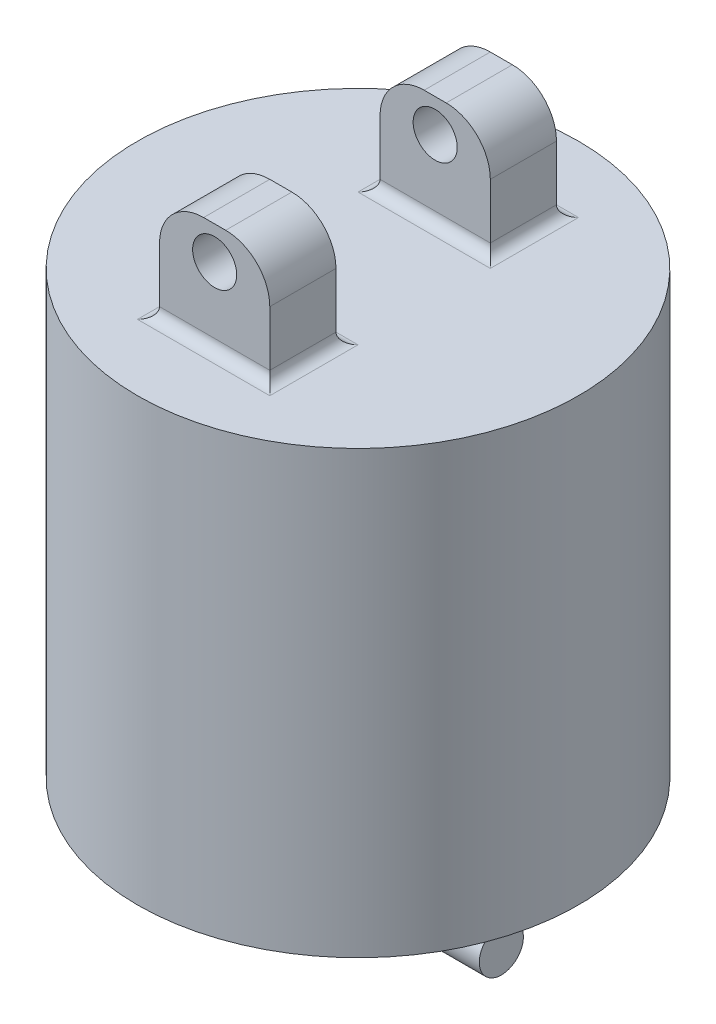
ISO-10303-21;
HEADER;
FILE_DESCRIPTION(('STEP AP214'),'2;1');
FILE_NAME('part.step','',(''),(''),'','','');
FILE_SCHEMA(('AUTOMOTIVE_DESIGN { 1 0 10303 214 1 1 1 1 }'));
ENDSEC;
DATA;
#1=APPLICATION_CONTEXT('core data for automotive mechanical design processes');
#2=APPLICATION_PROTOCOL_DEFINITION('international standard','automotive_design',2000,#1);
#3=PRODUCT_CONTEXT('',#1,'mechanical');
#4=PRODUCT('Part','Part','',(#3));
#5=PRODUCT_RELATED_PRODUCT_CATEGORY('part','',(#4));
#6=PRODUCT_DEFINITION_FORMATION('','',#4);
#7=PRODUCT_DEFINITION_CONTEXT('part definition',#1,'design');
#8=PRODUCT_DEFINITION('design','',#6,#7);
#9=PRODUCT_DEFINITION_SHAPE('','',#8);
#10=(LENGTH_UNIT() NAMED_UNIT(*) SI_UNIT(.MILLI.,.METRE.));
#11=(NAMED_UNIT(*) PLANE_ANGLE_UNIT() SI_UNIT($,.RADIAN.));
#12=(NAMED_UNIT(*) SI_UNIT($,.STERADIAN.) SOLID_ANGLE_UNIT());
#13=UNCERTAINTY_MEASURE_WITH_UNIT(LENGTH_MEASURE(1.E-05),#10,'distance_accuracy_value','');
#14=(GEOMETRIC_REPRESENTATION_CONTEXT(3) GLOBAL_UNCERTAINTY_ASSIGNED_CONTEXT((#13)) GLOBAL_UNIT_ASSIGNED_CONTEXT((#10,
#11,#12)) REPRESENTATION_CONTEXT('',''));
#15=CARTESIAN_POINT('',(0.,0.,0.));
#16=DIRECTION('',(0.,0.,1.));
#17=DIRECTION('',(1.,0.,0.));
#18=AXIS2_PLACEMENT_3D('',#15,#16,#17);
#19=CARTESIAN_POINT('',(0.,100.,0.));
#20=DIRECTION('',(0.,1.,0.));
#21=DIRECTION('',(0.,0.,1.));
#22=AXIS2_PLACEMENT_3D('',#19,#20,#21);
#23=PLANE('',#22);
#24=DIRECTION('',(-1.,0.,0.));
#25=VECTOR('',#24,1.);
#26=CARTESIAN_POINT('',(0.,100.,-35.));
#27=LINE('',#26,#25);
#28=CARTESIAN_POINT('',(-15.,100.,-35.));
#29=VERTEX_POINT('',#28);
#30=CARTESIAN_POINT('',(15.,100.,-35.));
#31=VERTEX_POINT('',#30);
#32=EDGE_CURVE('E279',#29,#31,#27,.F.);
#33=ORIENTED_EDGE('',*,*,#32,.T.);
#34=DIRECTION('',(0.,0.,-1.));
#35=VECTOR('',#34,1.);
#36=CARTESIAN_POINT('',(15.,100.,0.));
#37=LINE('',#36,#35);
#38=CARTESIAN_POINT('',(15.,100.,-15.));
#39=VERTEX_POINT('',#38);
#40=EDGE_CURVE('E283',#31,#39,#37,.F.);
#41=ORIENTED_EDGE('',*,*,#40,.T.);
#42=DIRECTION('',(1.,0.,0.));
#43=VECTOR('',#42,1.);
#44=CARTESIAN_POINT('',(0.,100.,-15.));
#45=LINE('',#44,#43);
#46=CARTESIAN_POINT('',(-15.,100.,-15.));
#47=VERTEX_POINT('',#46);
#48=EDGE_CURVE('E281',#39,#47,#45,.F.);
#49=ORIENTED_EDGE('',*,*,#48,.T.);
#50=DIRECTION('',(0.,0.,1.));
#51=VECTOR('',#50,1.);
#52=CARTESIAN_POINT('',(-15.,100.,0.));
#53=LINE('',#52,#51);
#54=EDGE_CURVE('E277',#47,#29,#53,.F.);
#55=ORIENTED_EDGE('',*,*,#54,.T.);
#56=EDGE_LOOP('',(#33,#41,#49,#55));
#57=FACE_BOUND('',#56,.T.);
#58=DIRECTION('',(1.,0.,0.));
#59=VECTOR('',#58,1.);
#60=CARTESIAN_POINT('',(0.,100.,35.));
#61=LINE('',#60,#59);
#62=CARTESIAN_POINT('',(15.,100.,35.));
#63=VERTEX_POINT('',#62);
#64=CARTESIAN_POINT('',(-15.,100.,35.));
#65=VERTEX_POINT('',#64);
#66=EDGE_CURVE('E237',#63,#65,#61,.F.);
#67=ORIENTED_EDGE('',*,*,#66,.T.);
#68=DIRECTION('',(0.,0.,1.));
#69=VECTOR('',#68,1.);
#70=CARTESIAN_POINT('',(-15.,100.,0.));
#71=LINE('',#70,#69);
#72=CARTESIAN_POINT('',(-15.,100.,15.));
#73=VERTEX_POINT('',#72);
#74=EDGE_CURVE('E218',#65,#73,#71,.F.);
#75=ORIENTED_EDGE('',*,*,#74,.T.);
#76=DIRECTION('',(-1.,0.,0.));
#77=VECTOR('',#76,1.);
#78=CARTESIAN_POINT('',(0.,100.,15.));
#79=LINE('',#78,#77);
#80=CARTESIAN_POINT('',(15.,100.,15.));
#81=VERTEX_POINT('',#80);
#82=EDGE_CURVE('E245',#73,#81,#79,.F.);
#83=ORIENTED_EDGE('',*,*,#82,.T.);
#84=DIRECTION('',(0.,0.,-1.));
#85=VECTOR('',#84,1.);
#86=CARTESIAN_POINT('',(15.,100.,0.));
#87=LINE('',#86,#85);
#88=EDGE_CURVE('E234',#81,#63,#87,.F.);
#89=ORIENTED_EDGE('',*,*,#88,.T.);
#90=EDGE_LOOP('',(#67,#75,#83,#89));
#91=FACE_BOUND('',#90,.T.);
#92=CARTESIAN_POINT('',(0.,100.,0.));
#93=DIRECTION('',(0.,1.,0.));
#94=DIRECTION('',(0.,0.,1.));
#95=AXIS2_PLACEMENT_3D('',#92,#93,#94);
#96=CIRCLE('',#95,50.);
#97=CARTESIAN_POINT('',(0.,100.,50.));
#98=VERTEX_POINT('',#97);
#99=EDGE_CURVE('E235',#98,#98,#96,.T.);
#100=ORIENTED_EDGE('',*,*,#99,.T.);
#101=EDGE_LOOP('',(#100));
#102=FACE_BOUND('',#101,.T.);
#103=ADVANCED_FACE('F33',(#57,#91,#102),#23,.T.);
#104=CARTESIAN_POINT('',(0.,100.,0.));
#105=DIRECTION('',(0.,-1.,0.));
#106=DIRECTION('',(0.,0.,-1.));
#107=AXIS2_PLACEMENT_3D('',#104,#105,#106);
#108=CYLINDRICAL_SURFACE('',#107,50.);
#109=ORIENTED_EDGE('',*,*,#99,.F.);
#110=EDGE_LOOP('',(#109));
#111=FACE_BOUND('',#110,.T.);
#112=CARTESIAN_POINT('',(0.,0.,0.));
#113=DIRECTION('',(0.,1.,0.));
#114=DIRECTION('',(0.,0.,1.));
#115=AXIS2_PLACEMENT_3D('',#112,#113,#114);
#116=CIRCLE('',#115,50.);
#117=CARTESIAN_POINT('',(0.,0.,50.));
#118=VERTEX_POINT('',#117);
#119=EDGE_CURVE('E240',#118,#118,#116,.T.);
#120=ORIENTED_EDGE('',*,*,#119,.T.);
#121=EDGE_LOOP('',(#120));
#122=FACE_BOUND('',#121,.T.);
#123=ADVANCED_FACE('F441',(#111,#122),#108,.T.);
#124=CARTESIAN_POINT('',(0.,0.,0.));
#125=DIRECTION('',(0.,1.,0.));
#126=DIRECTION('',(0.,0.,1.));
#127=AXIS2_PLACEMENT_3D('',#124,#125,#126);
#128=PLANE('',#127);
#129=DIRECTION('',(0.,0.,1.));
#130=VECTOR('',#129,1.);
#131=CARTESIAN_POINT('',(-17.5,0.,12.5));
#132=LINE('',#131,#130);
#133=CARTESIAN_POINT('',(-17.5,0.,-15.));
#134=VERTEX_POINT('',#133);
#135=CARTESIAN_POINT('',(-17.5,0.,15.));
#136=VERTEX_POINT('',#135);
#137=EDGE_CURVE('E330',#134,#136,#132,.T.);
#138=ORIENTED_EDGE('',*,*,#137,.T.);
#139=DIRECTION('',(1.,0.,0.));
#140=VECTOR('',#139,1.);
#141=CARTESIAN_POINT('',(0.,0.,15.));
#142=LINE('',#141,#140);
#143=CARTESIAN_POINT('',(17.5,0.,15.));
#144=VERTEX_POINT('',#143);
#145=EDGE_CURVE('E332',#136,#144,#142,.T.);
#146=ORIENTED_EDGE('',*,*,#145,.T.);
#147=DIRECTION('',(0.,0.,1.));
#148=VECTOR('',#147,1.);
#149=CARTESIAN_POINT('',(17.5,0.,0.));
#150=LINE('',#149,#148);
#151=CARTESIAN_POINT('',(17.5,0.,-15.));
#152=VERTEX_POINT('',#151);
#153=EDGE_CURVE('E326',#144,#152,#150,.F.);
#154=ORIENTED_EDGE('',*,*,#153,.T.);
#155=DIRECTION('',(1.,0.,0.));
#156=VECTOR('',#155,1.);
#157=CARTESIAN_POINT('',(0.,0.,-15.));
#158=LINE('',#157,#156);
#159=EDGE_CURVE('E328',#152,#134,#158,.F.);
#160=ORIENTED_EDGE('',*,*,#159,.T.);
#161=EDGE_LOOP('',(#138,#146,#154,#160));
#162=FACE_BOUND('',#161,.T.);
#163=ORIENTED_EDGE('',*,*,#119,.F.);
#164=EDGE_LOOP('',(#163));
#165=FACE_BOUND('',#164,.T.);
#166=ADVANCED_FACE('F443',(#162,#165),#128,.F.);
#167=CARTESIAN_POINT('',(12.5,125.,32.5));
#168=DIRECTION('',(-1.,0.,0.));
#169=DIRECTION('',(0.,0.,1.));
#170=AXIS2_PLACEMENT_3D('',#167,#168,#169);
#171=PLANE('',#170);
#172=DIRECTION('',(0.,-1.,0.));
#173=VECTOR('',#172,1.);
#174=CARTESIAN_POINT('',(12.5,125.,17.5));
#175=LINE('',#174,#173);
#176=CARTESIAN_POINT('',(12.5,115.,17.5));
#177=VERTEX_POINT('',#176);
#178=CARTESIAN_POINT('',(12.5,102.5,17.5));
#179=VERTEX_POINT('',#178);
#180=EDGE_CURVE('E435',#177,#179,#175,.T.);
#181=ORIENTED_EDGE('',*,*,#180,.F.);
#182=DIRECTION('',(0.,0.,-1.));
#183=VECTOR('',#182,1.);
#184=CARTESIAN_POINT('',(12.5,115.,32.5));
#185=LINE('',#184,#183);
#186=CARTESIAN_POINT('',(12.5,115.,32.5));
#187=VERTEX_POINT('',#186);
#188=EDGE_CURVE('E272',#177,#187,#185,.F.);
#189=ORIENTED_EDGE('',*,*,#188,.T.);
#190=DIRECTION('',(0.,-1.,0.));
#191=VECTOR('',#190,1.);
#192=CARTESIAN_POINT('',(12.5,125.,32.5));
#193=LINE('',#192,#191);
#194=CARTESIAN_POINT('',(12.5,102.5,32.5));
#195=VERTEX_POINT('',#194);
#196=EDGE_CURVE('E208',#187,#195,#193,.T.);
#197=ORIENTED_EDGE('',*,*,#196,.T.);
#198=DIRECTION('',(0.,0.,-1.));
#199=VECTOR('',#198,1.);
#200=CARTESIAN_POINT('',(12.5,102.5,32.5));
#201=LINE('',#200,#199);
#202=EDGE_CURVE('E228',#195,#179,#201,.T.);
#203=ORIENTED_EDGE('',*,*,#202,.T.);
#204=EDGE_LOOP('',(#181,#189,#197,#203));
#205=FACE_BOUND('',#204,.T.);
#206=ADVANCED_FACE('F445',(#205),#171,.F.);
#207=CARTESIAN_POINT('',(-12.5,125.,17.5));
#208=DIRECTION('',(0.,0.,1.));
#209=DIRECTION('',(1.,0.,0.));
#210=AXIS2_PLACEMENT_3D('',#207,#208,#209);
#211=PLANE('',#210);
#212=CARTESIAN_POINT('',(0.,117.5,17.5));
#213=DIRECTION('',(0.,0.,1.));
#214=DIRECTION('',(1.,0.,0.));
#215=AXIS2_PLACEMENT_3D('',#212,#213,#214);
#216=CIRCLE('',#215,5.00000000000001);
#217=CARTESIAN_POINT('',(5.,117.5,17.5));
#218=VERTEX_POINT('',#217);
#219=EDGE_CURVE('E222',#218,#218,#216,.T.);
#220=ORIENTED_EDGE('',*,*,#219,.T.);
#221=EDGE_LOOP('',(#220));
#222=FACE_BOUND('',#221,.T.);
#223=DIRECTION('',(0.,-1.,0.));
#224=VECTOR('',#223,1.);
#225=CARTESIAN_POINT('',(-12.5,125.,17.5));
#226=LINE('',#225,#224);
#227=CARTESIAN_POINT('',(-12.5,115.,17.5));
#228=VERTEX_POINT('',#227);
#229=CARTESIAN_POINT('',(-12.5,102.5,17.5));
#230=VERTEX_POINT('',#229);
#231=EDGE_CURVE('E207',#228,#230,#226,.T.);
#232=ORIENTED_EDGE('',*,*,#231,.F.);
#233=CARTESIAN_POINT('',(-2.50000000000001,115.,17.5));
#234=DIRECTION('',(0.,0.,1.));
#235=DIRECTION('',(1.,0.,0.));
#236=AXIS2_PLACEMENT_3D('',#233,#234,#235);
#237=CIRCLE('',#236,10.);
#238=CARTESIAN_POINT('',(-2.50000000000001,125.,17.5));
#239=VERTEX_POINT('',#238);
#240=EDGE_CURVE('E270',#228,#239,#237,.F.);
#241=ORIENTED_EDGE('',*,*,#240,.T.);
#242=DIRECTION('',(-1.,0.,0.));
#243=VECTOR('',#242,1.);
#244=CARTESIAN_POINT('',(-12.5,125.,17.5));
#245=LINE('',#244,#243);
#246=CARTESIAN_POINT('',(2.5,125.,17.5));
#247=VERTEX_POINT('',#246);
#248=EDGE_CURVE('E257',#247,#239,#245,.T.);
#249=ORIENTED_EDGE('',*,*,#248,.F.);
#250=CARTESIAN_POINT('',(2.5,115.,17.5));
#251=DIRECTION('',(0.,0.,1.));
#252=DIRECTION('',(1.,0.,0.));
#253=AXIS2_PLACEMENT_3D('',#250,#251,#252);
#254=CIRCLE('',#253,10.);
#255=EDGE_CURVE('E268',#247,#177,#254,.F.);
#256=ORIENTED_EDGE('',*,*,#255,.T.);
#257=ORIENTED_EDGE('',*,*,#180,.T.);
#258=DIRECTION('',(-1.,0.,0.));
#259=VECTOR('',#258,1.);
#260=CARTESIAN_POINT('',(-12.5,102.5,17.5));
#261=LINE('',#260,#259);
#262=EDGE_CURVE('E229',#179,#230,#261,.T.);
#263=ORIENTED_EDGE('',*,*,#262,.T.);
#264=EDGE_LOOP('',(#232,#241,#249,#256,#257,#263));
#265=FACE_BOUND('',#264,.T.);
#266=ADVANCED_FACE('F452',(#222,#265),#211,.F.);
#267=CARTESIAN_POINT('',(-12.5,125.,32.5));
#268=DIRECTION('',(1.,0.,0.));
#269=DIRECTION('',(0.,0.,-1.));
#270=AXIS2_PLACEMENT_3D('',#267,#268,#269);
#271=PLANE('',#270);
#272=DIRECTION('',(0.,-1.,0.));
#273=VECTOR('',#272,1.);
#274=CARTESIAN_POINT('',(-12.5,125.,32.5));
#275=LINE('',#274,#273);
#276=CARTESIAN_POINT('',(-12.5,115.,32.5));
#277=VERTEX_POINT('',#276);
#278=CARTESIAN_POINT('',(-12.5,102.5,32.5));
#279=VERTEX_POINT('',#278);
#280=EDGE_CURVE('E195',#277,#279,#275,.T.);
#281=ORIENTED_EDGE('',*,*,#280,.F.);
#282=DIRECTION('',(0.,0.,1.));
#283=VECTOR('',#282,1.);
#284=CARTESIAN_POINT('',(-12.5,115.,32.5));
#285=LINE('',#284,#283);
#286=EDGE_CURVE('E266',#277,#228,#285,.F.);
#287=ORIENTED_EDGE('',*,*,#286,.T.);
#288=ORIENTED_EDGE('',*,*,#231,.T.);
#289=DIRECTION('',(0.,0.,1.));
#290=VECTOR('',#289,1.);
#291=CARTESIAN_POINT('',(-12.5,102.5,32.5));
#292=LINE('',#291,#290);
#293=EDGE_CURVE('E216',#230,#279,#292,.T.);
#294=ORIENTED_EDGE('',*,*,#293,.T.);
#295=EDGE_LOOP('',(#281,#287,#288,#294));
#296=FACE_BOUND('',#295,.T.);
#297=ADVANCED_FACE('F231',(#296),#271,.F.);
#298=CARTESIAN_POINT('',(-12.5,125.,32.5));
#299=DIRECTION('',(0.,0.,-1.));
#300=DIRECTION('',(-1.,0.,0.));
#301=AXIS2_PLACEMENT_3D('',#298,#299,#300);
#302=PLANE('',#301);
#303=CARTESIAN_POINT('',(0.,117.5,32.5));
#304=DIRECTION('',(0.,0.,1.));
#305=DIRECTION('',(1.,0.,0.));
#306=AXIS2_PLACEMENT_3D('',#303,#304,#305);
#307=CIRCLE('',#306,5.00000000000001);
#308=CARTESIAN_POINT('',(5.,117.5,32.5));
#309=VERTEX_POINT('',#308);
#310=EDGE_CURVE('E423',#309,#309,#307,.T.);
#311=ORIENTED_EDGE('',*,*,#310,.F.);
#312=EDGE_LOOP('',(#311));
#313=FACE_BOUND('',#312,.T.);
#314=DIRECTION('',(1.,0.,0.));
#315=VECTOR('',#314,1.);
#316=CARTESIAN_POINT('',(-12.5,125.,32.5));
#317=LINE('',#316,#315);
#318=CARTESIAN_POINT('',(-2.50000000000001,125.,32.5));
#319=VERTEX_POINT('',#318);
#320=CARTESIAN_POINT('',(2.5,125.,32.5));
#321=VERTEX_POINT('',#320);
#322=EDGE_CURVE('E430',#319,#321,#317,.T.);
#323=ORIENTED_EDGE('',*,*,#322,.F.);
#324=CARTESIAN_POINT('',(-2.50000000000001,115.,32.5));
#325=DIRECTION('',(0.,0.,-1.));
#326=DIRECTION('',(-1.,0.,0.));
#327=AXIS2_PLACEMENT_3D('',#324,#325,#326);
#328=CIRCLE('',#327,10.);
#329=EDGE_CURVE('E203',#319,#277,#328,.F.);
#330=ORIENTED_EDGE('',*,*,#329,.T.);
#331=ORIENTED_EDGE('',*,*,#280,.T.);
#332=DIRECTION('',(1.,0.,0.));
#333=VECTOR('',#332,1.);
#334=CARTESIAN_POINT('',(-12.5,102.5,32.5));
#335=LINE('',#334,#333);
#336=EDGE_CURVE('E201',#279,#195,#335,.T.);
#337=ORIENTED_EDGE('',*,*,#336,.T.);
#338=ORIENTED_EDGE('',*,*,#196,.F.);
#339=CARTESIAN_POINT('',(2.5,115.,32.5));
#340=DIRECTION('',(0.,0.,-1.));
#341=DIRECTION('',(-1.,0.,0.));
#342=AXIS2_PLACEMENT_3D('',#339,#340,#341);
#343=CIRCLE('',#342,10.);
#344=EDGE_CURVE('E263',#187,#321,#343,.F.);
#345=ORIENTED_EDGE('',*,*,#344,.T.);
#346=EDGE_LOOP('',(#323,#330,#331,#337,#338,#345));
#347=FACE_BOUND('',#346,.T.);
#348=ADVANCED_FACE('F198',(#313,#347),#302,.F.);
#349=CARTESIAN_POINT('',(0.,125.,0.));
#350=DIRECTION('',(0.,-1.,0.));
#351=DIRECTION('',(0.,0.,-1.));
#352=AXIS2_PLACEMENT_3D('',#349,#350,#351);
#353=PLANE('',#352);
#354=ORIENTED_EDGE('',*,*,#248,.T.);
#355=DIRECTION('',(0.,0.,1.));
#356=VECTOR('',#355,1.);
#357=CARTESIAN_POINT('',(-2.50000000000001,125.,0.));
#358=LINE('',#357,#356);
#359=EDGE_CURVE('E260',#239,#319,#358,.T.);
#360=ORIENTED_EDGE('',*,*,#359,.T.);
#361=ORIENTED_EDGE('',*,*,#322,.T.);
#362=DIRECTION('',(0.,0.,-1.));
#363=VECTOR('',#362,1.);
#364=CARTESIAN_POINT('',(2.5,125.,0.));
#365=LINE('',#364,#363);
#366=EDGE_CURVE('E250',#321,#247,#365,.T.);
#367=ORIENTED_EDGE('',*,*,#366,.T.);
#368=EDGE_LOOP('',(#354,#360,#361,#367));
#369=FACE_BOUND('',#368,.T.);
#370=ADVANCED_FACE('F471',(#369),#353,.F.);
#371=CARTESIAN_POINT('',(15.,102.5,32.5));
#372=DIRECTION('',(0.,0.,-1.));
#373=DIRECTION('',(-1.,0.,0.));
#374=AXIS2_PLACEMENT_3D('',#371,#372,#373);
#375=CYLINDRICAL_SURFACE('',#374,2.5);
#376=CARTESIAN_POINT('',(15.,102.5,35.));
#377=DIRECTION('',(0.707106781186547,0.,-0.707106781186547));
#378=DIRECTION('',(-0.707106781186547,0.,-0.707106781186547));
#379=AXIS2_PLACEMENT_3D('',#376,#377,#378);
#380=ELLIPSE('',#379,3.53553390593274,2.5);
#381=EDGE_CURVE('E227',#63,#195,#380,.T.);
#382=ORIENTED_EDGE('',*,*,#381,.F.);
#383=ORIENTED_EDGE('',*,*,#88,.F.);
#384=CARTESIAN_POINT('',(15.,102.5,15.));
#385=DIRECTION('',(-0.707106781186547,0.,-0.707106781186547));
#386=DIRECTION('',(0.707106781186547,0.,-0.707106781186547));
#387=AXIS2_PLACEMENT_3D('',#384,#385,#386);
#388=ELLIPSE('',#387,3.53553390593274,2.5);
#389=EDGE_CURVE('E254',#179,#81,#388,.F.);
#390=ORIENTED_EDGE('',*,*,#389,.F.);
#391=ORIENTED_EDGE('',*,*,#202,.F.);
#392=EDGE_LOOP('',(#382,#383,#390,#391));
#393=FACE_BOUND('',#392,.T.);
#394=ADVANCED_FACE('F475',(#393),#375,.F.);
#395=CARTESIAN_POINT('',(-12.5,102.5,15.));
#396=DIRECTION('',(-1.,0.,0.));
#397=DIRECTION('',(0.,0.,1.));
#398=AXIS2_PLACEMENT_3D('',#395,#396,#397);
#399=CYLINDRICAL_SURFACE('',#398,2.5);
#400=ORIENTED_EDGE('',*,*,#389,.T.);
#401=ORIENTED_EDGE('',*,*,#82,.F.);
#402=CARTESIAN_POINT('',(-15.,102.5,15.));
#403=DIRECTION('',(-0.707106781186547,0.,0.707106781186547));
#404=DIRECTION('',(-0.707106781186547,0.,-0.707106781186547));
#405=AXIS2_PLACEMENT_3D('',#402,#403,#404);
#406=ELLIPSE('',#405,3.53553390593274,2.5);
#407=EDGE_CURVE('E221',#230,#73,#406,.F.);
#408=ORIENTED_EDGE('',*,*,#407,.F.);
#409=ORIENTED_EDGE('',*,*,#262,.F.);
#410=EDGE_LOOP('',(#400,#401,#408,#409));
#411=FACE_BOUND('',#410,.T.);
#412=ADVANCED_FACE('F770',(#411),#399,.F.);
#413=CARTESIAN_POINT('',(-12.5,102.5,35.));
#414=DIRECTION('',(1.,0.,0.));
#415=DIRECTION('',(0.,0.,-1.));
#416=AXIS2_PLACEMENT_3D('',#413,#414,#415);
#417=CYLINDRICAL_SURFACE('',#416,2.5);
#418=ORIENTED_EDGE('',*,*,#381,.T.);
#419=ORIENTED_EDGE('',*,*,#336,.F.);
#420=CARTESIAN_POINT('',(-15.,102.5,35.));
#421=DIRECTION('',(0.707106781186547,0.,0.707106781186547));
#422=DIRECTION('',(0.707106781186547,0.,-0.707106781186547));
#423=AXIS2_PLACEMENT_3D('',#420,#421,#422);
#424=ELLIPSE('',#423,3.53553390593274,2.5);
#425=EDGE_CURVE('E214',#65,#279,#424,.T.);
#426=ORIENTED_EDGE('',*,*,#425,.F.);
#427=ORIENTED_EDGE('',*,*,#66,.F.);
#428=EDGE_LOOP('',(#418,#419,#426,#427));
#429=FACE_BOUND('',#428,.T.);
#430=ADVANCED_FACE('F225',(#429),#417,.F.);
#431=CARTESIAN_POINT('',(-15.,102.5,32.5));
#432=DIRECTION('',(0.,0.,1.));
#433=DIRECTION('',(1.,0.,0.));
#434=AXIS2_PLACEMENT_3D('',#431,#432,#433);
#435=CYLINDRICAL_SURFACE('',#434,2.5);
#436=ORIENTED_EDGE('',*,*,#407,.T.);
#437=ORIENTED_EDGE('',*,*,#74,.F.);
#438=ORIENTED_EDGE('',*,*,#425,.T.);
#439=ORIENTED_EDGE('',*,*,#293,.F.);
#440=EDGE_LOOP('',(#436,#437,#438,#439));
#441=FACE_BOUND('',#440,.T.);
#442=ADVANCED_FACE('F215',(#441),#435,.F.);
#443=CARTESIAN_POINT('',(-2.50000000000001,115.,0.));
#444=DIRECTION('',(0.,0.,1.));
#445=DIRECTION('',(1.,0.,0.));
#446=AXIS2_PLACEMENT_3D('',#443,#444,#445);
#447=CYLINDRICAL_SURFACE('',#446,10.);
#448=ORIENTED_EDGE('',*,*,#240,.F.);
#449=ORIENTED_EDGE('',*,*,#286,.F.);
#450=ORIENTED_EDGE('',*,*,#329,.F.);
#451=ORIENTED_EDGE('',*,*,#359,.F.);
#452=EDGE_LOOP('',(#448,#449,#450,#451));
#453=FACE_BOUND('',#452,.T.);
#454=ADVANCED_FACE('F743',(#453),#447,.T.);
#455=CARTESIAN_POINT('',(2.5,115.,0.));
#456=DIRECTION('',(0.,0.,-1.));
#457=DIRECTION('',(-1.,0.,0.));
#458=AXIS2_PLACEMENT_3D('',#455,#456,#457);
#459=CYLINDRICAL_SURFACE('',#458,10.);
#460=ORIENTED_EDGE('',*,*,#344,.F.);
#461=ORIENTED_EDGE('',*,*,#188,.F.);
#462=ORIENTED_EDGE('',*,*,#255,.F.);
#463=ORIENTED_EDGE('',*,*,#366,.F.);
#464=EDGE_LOOP('',(#460,#461,#462,#463));
#465=FACE_BOUND('',#464,.T.);
#466=ADVANCED_FACE('F481',(#465),#459,.T.);
#467=CARTESIAN_POINT('',(0.,117.5,7.5));
#468=DIRECTION('',(0.,0.,1.));
#469=DIRECTION('',(1.,0.,0.));
#470=AXIS2_PLACEMENT_3D('',#467,#468,#469);
#471=CYLINDRICAL_SURFACE('',#470,5.00000000000001);
#472=ORIENTED_EDGE('',*,*,#310,.T.);
#473=EDGE_LOOP('',(#472));
#474=FACE_BOUND('',#473,.T.);
#475=ORIENTED_EDGE('',*,*,#219,.F.);
#476=EDGE_LOOP('',(#475));
#477=FACE_BOUND('',#476,.T.);
#478=ADVANCED_FACE('F477',(#474,#477),#471,.F.);
#479=CARTESIAN_POINT('',(-12.5,125.,-32.5));
#480=DIRECTION('',(1.,0.,0.));
#481=DIRECTION('',(0.,0.,-1.));
#482=AXIS2_PLACEMENT_3D('',#479,#480,#481);
#483=PLANE('',#482);
#484=DIRECTION('',(0.,-1.,0.));
#485=VECTOR('',#484,1.);
#486=CARTESIAN_POINT('',(-12.5,125.,-17.5));
#487=LINE('',#486,#485);
#488=CARTESIAN_POINT('',(-12.5,115.,-17.5));
#489=VERTEX_POINT('',#488);
#490=CARTESIAN_POINT('',(-12.5,102.5,-17.5));
#491=VERTEX_POINT('',#490);
#492=EDGE_CURVE('E421',#489,#491,#487,.T.);
#493=ORIENTED_EDGE('',*,*,#492,.F.);
#494=DIRECTION('',(0.,0.,1.));
#495=VECTOR('',#494,1.);
#496=CARTESIAN_POINT('',(-12.5,115.,-32.5));
#497=LINE('',#496,#495);
#498=CARTESIAN_POINT('',(-12.5,115.,-32.5));
#499=VERTEX_POINT('',#498);
#500=EDGE_CURVE('E324',#489,#499,#497,.F.);
#501=ORIENTED_EDGE('',*,*,#500,.T.);
#502=DIRECTION('',(0.,-1.,0.));
#503=VECTOR('',#502,1.);
#504=CARTESIAN_POINT('',(-12.5,125.,-32.5));
#505=LINE('',#504,#503);
#506=CARTESIAN_POINT('',(-12.5,102.5,-32.5));
#507=VERTEX_POINT('',#506);
#508=EDGE_CURVE('E415',#499,#507,#505,.T.);
#509=ORIENTED_EDGE('',*,*,#508,.T.);
#510=DIRECTION('',(0.,0.,1.));
#511=VECTOR('',#510,1.);
#512=CARTESIAN_POINT('',(-12.5,102.5,-32.5));
#513=LINE('',#512,#511);
#514=EDGE_CURVE('E292',#507,#491,#513,.T.);
#515=ORIENTED_EDGE('',*,*,#514,.T.);
#516=EDGE_LOOP('',(#493,#501,#509,#515));
#517=FACE_BOUND('',#516,.T.);
#518=ADVANCED_FACE('F480',(#517),#483,.F.);
#519=CARTESIAN_POINT('',(12.5,125.,-17.5));
#520=DIRECTION('',(0.,0.,-1.));
#521=DIRECTION('',(-1.,0.,0.));
#522=AXIS2_PLACEMENT_3D('',#519,#520,#521);
#523=PLANE('',#522);
#524=CARTESIAN_POINT('',(0.,117.5,-17.5));
#525=DIRECTION('',(0.,0.,-1.));
#526=DIRECTION('',(-1.,0.,0.));
#527=AXIS2_PLACEMENT_3D('',#524,#525,#526);
#528=CIRCLE('',#527,5.00000000000001);
#529=CARTESIAN_POINT('',(-5.,117.5,-17.5));
#530=VERTEX_POINT('',#529);
#531=EDGE_CURVE('E300',#530,#530,#528,.T.);
#532=ORIENTED_EDGE('',*,*,#531,.T.);
#533=EDGE_LOOP('',(#532));
#534=FACE_BOUND('',#533,.T.);
#535=DIRECTION('',(0.,-1.,0.));
#536=VECTOR('',#535,1.);
#537=CARTESIAN_POINT('',(12.5,125.,-17.5));
#538=LINE('',#537,#536);
#539=CARTESIAN_POINT('',(12.5,115.,-17.5));
#540=VERTEX_POINT('',#539);
#541=CARTESIAN_POINT('',(12.5,102.5,-17.5));
#542=VERTEX_POINT('',#541);
#543=EDGE_CURVE('E419',#540,#542,#538,.T.);
#544=ORIENTED_EDGE('',*,*,#543,.F.);
#545=CARTESIAN_POINT('',(2.50000000000001,115.,-17.5));
#546=DIRECTION('',(0.,0.,-1.));
#547=DIRECTION('',(-1.,0.,0.));
#548=AXIS2_PLACEMENT_3D('',#545,#546,#547);
#549=CIRCLE('',#548,10.);
#550=CARTESIAN_POINT('',(2.50000000000001,125.,-17.5));
#551=VERTEX_POINT('',#550);
#552=EDGE_CURVE('E322',#540,#551,#549,.F.);
#553=ORIENTED_EDGE('',*,*,#552,.T.);
#554=DIRECTION('',(1.,0.,0.));
#555=VECTOR('',#554,1.);
#556=CARTESIAN_POINT('',(12.5,125.,-17.5));
#557=LINE('',#556,#555);
#558=CARTESIAN_POINT('',(-2.5,125.,-17.5));
#559=VERTEX_POINT('',#558);
#560=EDGE_CURVE('E308',#559,#551,#557,.T.);
#561=ORIENTED_EDGE('',*,*,#560,.F.);
#562=CARTESIAN_POINT('',(-2.5,115.,-17.5));
#563=DIRECTION('',(0.,0.,-1.));
#564=DIRECTION('',(-1.,0.,0.));
#565=AXIS2_PLACEMENT_3D('',#562,#563,#564);
#566=CIRCLE('',#565,10.);
#567=EDGE_CURVE('E320',#559,#489,#566,.F.);
#568=ORIENTED_EDGE('',*,*,#567,.T.);
#569=ORIENTED_EDGE('',*,*,#492,.T.);
#570=DIRECTION('',(1.,0.,0.));
#571=VECTOR('',#570,1.);
#572=CARTESIAN_POINT('',(12.5,102.5,-17.5));
#573=LINE('',#572,#571);
#574=EDGE_CURVE('E286',#491,#542,#573,.T.);
#575=ORIENTED_EDGE('',*,*,#574,.T.);
#576=EDGE_LOOP('',(#544,#553,#561,#568,#569,#575));
#577=FACE_BOUND('',#576,.T.);
#578=ADVANCED_FACE('F485',(#534,#577),#523,.F.);
#579=CARTESIAN_POINT('',(12.5,125.,-32.5));
#580=DIRECTION('',(-1.,0.,0.));
#581=DIRECTION('',(0.,0.,1.));
#582=AXIS2_PLACEMENT_3D('',#579,#580,#581);
#583=PLANE('',#582);
#584=DIRECTION('',(0.,-1.,0.));
#585=VECTOR('',#584,1.);
#586=CARTESIAN_POINT('',(12.5,125.,-32.5));
#587=LINE('',#586,#585);
#588=CARTESIAN_POINT('',(12.5,115.,-32.5));
#589=VERTEX_POINT('',#588);
#590=CARTESIAN_POINT('',(12.5,102.5,-32.5));
#591=VERTEX_POINT('',#590);
#592=EDGE_CURVE('E417',#589,#591,#587,.T.);
#593=ORIENTED_EDGE('',*,*,#592,.F.);
#594=DIRECTION('',(0.,0.,-1.));
#595=VECTOR('',#594,1.);
#596=CARTESIAN_POINT('',(12.5,115.,-32.5));
#597=LINE('',#596,#595);
#598=EDGE_CURVE('E318',#589,#540,#597,.F.);
#599=ORIENTED_EDGE('',*,*,#598,.T.);
#600=ORIENTED_EDGE('',*,*,#543,.T.);
#601=DIRECTION('',(0.,0.,-1.));
#602=VECTOR('',#601,1.);
#603=CARTESIAN_POINT('',(12.5,102.5,-32.5));
#604=LINE('',#603,#602);
#605=EDGE_CURVE('E274',#542,#591,#604,.T.);
#606=ORIENTED_EDGE('',*,*,#605,.T.);
#607=EDGE_LOOP('',(#593,#599,#600,#606));
#608=FACE_BOUND('',#607,.T.);
#609=ADVANCED_FACE('F489',(#608),#583,.F.);
#610=CARTESIAN_POINT('',(12.5,125.,-32.5));
#611=DIRECTION('',(0.,0.,1.));
#612=DIRECTION('',(1.,0.,0.));
#613=AXIS2_PLACEMENT_3D('',#610,#611,#612);
#614=PLANE('',#613);
#615=CARTESIAN_POINT('',(0.,117.5,-32.5));
#616=DIRECTION('',(0.,0.,-1.));
#617=DIRECTION('',(-1.,0.,0.));
#618=AXIS2_PLACEMENT_3D('',#615,#616,#617);
#619=CIRCLE('',#618,5.00000000000001);
#620=CARTESIAN_POINT('',(-5.,117.5,-32.5));
#621=VERTEX_POINT('',#620);
#622=EDGE_CURVE('E405',#621,#621,#619,.T.);
#623=ORIENTED_EDGE('',*,*,#622,.F.);
#624=EDGE_LOOP('',(#623));
#625=FACE_BOUND('',#624,.T.);
#626=DIRECTION('',(-1.,0.,0.));
#627=VECTOR('',#626,1.);
#628=CARTESIAN_POINT('',(12.5,125.,-32.5));
#629=LINE('',#628,#627);
#630=CARTESIAN_POINT('',(2.50000000000001,125.,-32.5));
#631=VERTEX_POINT('',#630);
#632=CARTESIAN_POINT('',(-2.5,125.,-32.5));
#633=VERTEX_POINT('',#632);
#634=EDGE_CURVE('E412',#631,#633,#629,.T.);
#635=ORIENTED_EDGE('',*,*,#634,.F.);
#636=CARTESIAN_POINT('',(2.50000000000001,115.,-32.5));
#637=DIRECTION('',(0.,0.,1.));
#638=DIRECTION('',(1.,0.,0.));
#639=AXIS2_PLACEMENT_3D('',#636,#637,#638);
#640=CIRCLE('',#639,10.);
#641=EDGE_CURVE('E316',#631,#589,#640,.F.);
#642=ORIENTED_EDGE('',*,*,#641,.T.);
#643=ORIENTED_EDGE('',*,*,#592,.T.);
#644=DIRECTION('',(-1.,0.,0.));
#645=VECTOR('',#644,1.);
#646=CARTESIAN_POINT('',(12.5,102.5,-32.5));
#647=LINE('',#646,#645);
#648=EDGE_CURVE('E289',#591,#507,#647,.T.);
#649=ORIENTED_EDGE('',*,*,#648,.T.);
#650=ORIENTED_EDGE('',*,*,#508,.F.);
#651=CARTESIAN_POINT('',(-2.5,115.,-32.5));
#652=DIRECTION('',(0.,0.,1.));
#653=DIRECTION('',(1.,0.,0.));
#654=AXIS2_PLACEMENT_3D('',#651,#652,#653);
#655=CIRCLE('',#654,10.);
#656=EDGE_CURVE('E314',#499,#633,#655,.F.);
#657=ORIENTED_EDGE('',*,*,#656,.T.);
#658=EDGE_LOOP('',(#635,#642,#643,#649,#650,#657));
#659=FACE_BOUND('',#658,.T.);
#660=ADVANCED_FACE('F493',(#625,#659),#614,.F.);
#661=CARTESIAN_POINT('',(0.,125.,0.));
#662=DIRECTION('',(0.,-1.,0.));
#663=DIRECTION('',(0.,0.,1.));
#664=AXIS2_PLACEMENT_3D('',#661,#662,#663);
#665=PLANE('',#664);
#666=ORIENTED_EDGE('',*,*,#560,.T.);
#667=DIRECTION('',(0.,0.,-1.));
#668=VECTOR('',#667,1.);
#669=CARTESIAN_POINT('',(2.50000000000001,125.,0.));
#670=LINE('',#669,#668);
#671=EDGE_CURVE('E311',#551,#631,#670,.T.);
#672=ORIENTED_EDGE('',*,*,#671,.T.);
#673=ORIENTED_EDGE('',*,*,#634,.T.);
#674=DIRECTION('',(0.,0.,1.));
#675=VECTOR('',#674,1.);
#676=CARTESIAN_POINT('',(-2.5,125.,0.));
#677=LINE('',#676,#675);
#678=EDGE_CURVE('E295',#633,#559,#677,.T.);
#679=ORIENTED_EDGE('',*,*,#678,.T.);
#680=EDGE_LOOP('',(#666,#672,#673,#679));
#681=FACE_BOUND('',#680,.T.);
#682=ADVANCED_FACE('F497',(#681),#665,.F.);
#683=CARTESIAN_POINT('',(-15.,102.5,-32.5));
#684=DIRECTION('',(0.,0.,1.));
#685=DIRECTION('',(1.,0.,0.));
#686=AXIS2_PLACEMENT_3D('',#683,#684,#685);
#687=CYLINDRICAL_SURFACE('',#686,2.5);
#688=CARTESIAN_POINT('',(-15.,102.5,-35.));
#689=DIRECTION('',(-0.707106781186547,0.,0.707106781186547));
#690=DIRECTION('',(0.707106781186547,0.,0.707106781186547));
#691=AXIS2_PLACEMENT_3D('',#688,#689,#690);
#692=ELLIPSE('',#691,3.53553390593274,2.5);
#693=EDGE_CURVE('E302',#29,#507,#692,.T.);
#694=ORIENTED_EDGE('',*,*,#693,.F.);
#695=ORIENTED_EDGE('',*,*,#54,.F.);
#696=CARTESIAN_POINT('',(-15.,102.5,-15.));
#697=DIRECTION('',(0.707106781186547,0.,0.707106781186547));
#698=DIRECTION('',(-0.707106781186547,0.,0.707106781186547));
#699=AXIS2_PLACEMENT_3D('',#696,#697,#698);
#700=ELLIPSE('',#699,3.53553390593274,2.5);
#701=EDGE_CURVE('E305',#491,#47,#700,.F.);
#702=ORIENTED_EDGE('',*,*,#701,.F.);
#703=ORIENTED_EDGE('',*,*,#514,.F.);
#704=EDGE_LOOP('',(#694,#695,#702,#703));
#705=FACE_BOUND('',#704,.T.);
#706=ADVANCED_FACE('F501',(#705),#687,.F.);
#707=CARTESIAN_POINT('',(12.5,102.5,-15.));
#708=DIRECTION('',(1.,0.,0.));
#709=DIRECTION('',(0.,0.,-1.));
#710=AXIS2_PLACEMENT_3D('',#707,#708,#709);
#711=CYLINDRICAL_SURFACE('',#710,2.5);
#712=ORIENTED_EDGE('',*,*,#701,.T.);
#713=ORIENTED_EDGE('',*,*,#48,.F.);
#714=CARTESIAN_POINT('',(15.,102.5,-15.));
#715=DIRECTION('',(0.707106781186547,0.,-0.707106781186547));
#716=DIRECTION('',(0.707106781186547,0.,0.707106781186547));
#717=AXIS2_PLACEMENT_3D('',#714,#715,#716);
#718=ELLIPSE('',#717,3.53553390593274,2.5);
#719=EDGE_CURVE('E299',#542,#39,#718,.F.);
#720=ORIENTED_EDGE('',*,*,#719,.F.);
#721=ORIENTED_EDGE('',*,*,#574,.F.);
#722=EDGE_LOOP('',(#712,#713,#720,#721));
#723=FACE_BOUND('',#722,.T.);
#724=ADVANCED_FACE('F683',(#723),#711,.F.);
#725=CARTESIAN_POINT('',(12.5,102.5,-35.));
#726=DIRECTION('',(-1.,0.,0.));
#727=DIRECTION('',(0.,0.,1.));
#728=AXIS2_PLACEMENT_3D('',#725,#726,#727);
#729=CYLINDRICAL_SURFACE('',#728,2.5);
#730=ORIENTED_EDGE('',*,*,#693,.T.);
#731=ORIENTED_EDGE('',*,*,#648,.F.);
#732=CARTESIAN_POINT('',(15.,102.5,-35.));
#733=DIRECTION('',(-0.707106781186547,0.,-0.707106781186547));
#734=DIRECTION('',(-0.707106781186547,0.,0.707106781186547));
#735=AXIS2_PLACEMENT_3D('',#732,#733,#734);
#736=ELLIPSE('',#735,3.53553390593274,2.5);
#737=EDGE_CURVE('E296',#31,#591,#736,.T.);
#738=ORIENTED_EDGE('',*,*,#737,.F.);
#739=ORIENTED_EDGE('',*,*,#32,.F.);
#740=EDGE_LOOP('',(#730,#731,#738,#739));
#741=FACE_BOUND('',#740,.T.);
#742=ADVANCED_FACE('F674',(#741),#729,.F.);
#743=CARTESIAN_POINT('',(15.,102.5,-32.5));
#744=DIRECTION('',(0.,0.,-1.));
#745=DIRECTION('',(-1.,0.,0.));
#746=AXIS2_PLACEMENT_3D('',#743,#744,#745);
#747=CYLINDRICAL_SURFACE('',#746,2.5);
#748=ORIENTED_EDGE('',*,*,#719,.T.);
#749=ORIENTED_EDGE('',*,*,#40,.F.);
#750=ORIENTED_EDGE('',*,*,#737,.T.);
#751=ORIENTED_EDGE('',*,*,#605,.F.);
#752=EDGE_LOOP('',(#748,#749,#750,#751));
#753=FACE_BOUND('',#752,.T.);
#754=ADVANCED_FACE('F665',(#753),#747,.F.);
#755=CARTESIAN_POINT('',(2.50000000000001,115.,0.));
#756=DIRECTION('',(0.,0.,-1.));
#757=DIRECTION('',(-1.,0.,0.));
#758=AXIS2_PLACEMENT_3D('',#755,#756,#757);
#759=CYLINDRICAL_SURFACE('',#758,10.);
#760=ORIENTED_EDGE('',*,*,#552,.F.);
#761=ORIENTED_EDGE('',*,*,#598,.F.);
#762=ORIENTED_EDGE('',*,*,#641,.F.);
#763=ORIENTED_EDGE('',*,*,#671,.F.);
#764=EDGE_LOOP('',(#760,#761,#762,#763));
#765=FACE_BOUND('',#764,.T.);
#766=ADVANCED_FACE('F656',(#765),#759,.T.);
#767=CARTESIAN_POINT('',(-2.5,115.,0.));
#768=DIRECTION('',(0.,0.,1.));
#769=DIRECTION('',(1.,0.,0.));
#770=AXIS2_PLACEMENT_3D('',#767,#768,#769);
#771=CYLINDRICAL_SURFACE('',#770,10.);
#772=ORIENTED_EDGE('',*,*,#656,.F.);
#773=ORIENTED_EDGE('',*,*,#500,.F.);
#774=ORIENTED_EDGE('',*,*,#567,.F.);
#775=ORIENTED_EDGE('',*,*,#678,.F.);
#776=EDGE_LOOP('',(#772,#773,#774,#775));
#777=FACE_BOUND('',#776,.T.);
#778=ADVANCED_FACE('F506',(#777),#771,.T.);
#779=CARTESIAN_POINT('',(0.,117.5,-7.5));
#780=DIRECTION('',(0.,0.,-1.));
#781=DIRECTION('',(-1.,0.,0.));
#782=AXIS2_PLACEMENT_3D('',#779,#780,#781);
#783=CYLINDRICAL_SURFACE('',#782,5.00000000000001);
#784=ORIENTED_EDGE('',*,*,#622,.T.);
#785=EDGE_LOOP('',(#784));
#786=FACE_BOUND('',#785,.T.);
#787=ORIENTED_EDGE('',*,*,#531,.F.);
#788=EDGE_LOOP('',(#787));
#789=FACE_BOUND('',#788,.T.);
#790=ADVANCED_FACE('F503',(#786,#789),#783,.F.);
#791=CARTESIAN_POINT('',(-15.,-25.,12.5));
#792=DIRECTION('',(0.,0.,1.));
#793=DIRECTION('',(1.,0.,0.));
#794=AXIS2_PLACEMENT_3D('',#791,#792,#793);
#795=PLANE('',#794);
#796=DIRECTION('',(0.,-1.,0.));
#797=VECTOR('',#796,1.);
#798=CARTESIAN_POINT('',(-15.,-25.,12.5));
#799=LINE('',#798,#797);
#800=CARTESIAN_POINT('',(-15.,-2.5,12.5));
#801=VERTEX_POINT('',#800);
#802=CARTESIAN_POINT('',(-15.,-15.,12.5));
#803=VERTEX_POINT('',#802);
#804=EDGE_CURVE('E376',#801,#803,#799,.T.);
#805=ORIENTED_EDGE('',*,*,#804,.T.);
#806=DIRECTION('',(1.,0.,0.));
#807=VECTOR('',#806,1.);
#808=CARTESIAN_POINT('',(-15.,-15.,12.5));
#809=LINE('',#808,#807);
#810=CARTESIAN_POINT('',(15.,-15.,12.5));
#811=VERTEX_POINT('',#810);
#812=EDGE_CURVE('E346',#803,#811,#809,.T.);
#813=ORIENTED_EDGE('',*,*,#812,.T.);
#814=DIRECTION('',(0.,-1.,0.));
#815=VECTOR('',#814,1.);
#816=CARTESIAN_POINT('',(15.,-25.,12.5));
#817=LINE('',#816,#815);
#818=CARTESIAN_POINT('',(15.,-2.5,12.5));
#819=VERTEX_POINT('',#818);
#820=EDGE_CURVE('E358',#819,#811,#817,.T.);
#821=ORIENTED_EDGE('',*,*,#820,.F.);
#822=DIRECTION('',(1.,0.,0.));
#823=VECTOR('',#822,1.);
#824=CARTESIAN_POINT('',(-15.,-2.5,12.5));
#825=LINE('',#824,#823);
#826=EDGE_CURVE('E335',#819,#801,#825,.F.);
#827=ORIENTED_EDGE('',*,*,#826,.T.);
#828=EDGE_LOOP('',(#805,#813,#821,#827));
#829=FACE_BOUND('',#828,.T.);
#830=ADVANCED_FACE('F382',(#829),#795,.T.);
#831=CARTESIAN_POINT('',(-15.,-25.,-12.5));
#832=DIRECTION('',(0.,0.,-1.));
#833=DIRECTION('',(-1.,0.,0.));
#834=AXIS2_PLACEMENT_3D('',#831,#832,#833);
#835=PLANE('',#834);
#836=DIRECTION('',(0.,1.,0.));
#837=VECTOR('',#836,1.);
#838=CARTESIAN_POINT('',(15.,-25.,-12.5));
#839=LINE('',#838,#837);
#840=CARTESIAN_POINT('',(15.,-15.,-12.5));
#841=VERTEX_POINT('',#840);
#842=CARTESIAN_POINT('',(15.,-2.5,-12.5));
#843=VERTEX_POINT('',#842);
#844=EDGE_CURVE('E386',#841,#843,#839,.T.);
#845=ORIENTED_EDGE('',*,*,#844,.F.);
#846=DIRECTION('',(1.,0.,0.));
#847=VECTOR('',#846,1.);
#848=CARTESIAN_POINT('',(-15.,-15.,-12.5));
#849=LINE('',#848,#847);
#850=CARTESIAN_POINT('',(-15.,-15.,-12.5));
#851=VERTEX_POINT('',#850);
#852=EDGE_CURVE('E41',#841,#851,#849,.F.);
#853=ORIENTED_EDGE('',*,*,#852,.T.);
#854=DIRECTION('',(0.,1.,0.));
#855=VECTOR('',#854,1.);
#856=CARTESIAN_POINT('',(-15.,-25.,-12.5));
#857=LINE('',#856,#855);
#858=CARTESIAN_POINT('',(-15.,-2.5,-12.5));
#859=VERTEX_POINT('',#858);
#860=EDGE_CURVE('E403',#851,#859,#857,.T.);
#861=ORIENTED_EDGE('',*,*,#860,.T.);
#862=DIRECTION('',(1.,0.,0.));
#863=VECTOR('',#862,1.);
#864=CARTESIAN_POINT('',(-15.,-2.5,-12.5));
#865=LINE('',#864,#863);
#866=EDGE_CURVE('E341',#859,#843,#865,.T.);
#867=ORIENTED_EDGE('',*,*,#866,.T.);
#868=EDGE_LOOP('',(#845,#853,#861,#867));
#869=FACE_BOUND('',#868,.T.);
#870=ADVANCED_FACE('F510',(#869),#835,.T.);
#871=CARTESIAN_POINT('',(-15.,-25.,-12.5));
#872=DIRECTION('',(0.,-1.,0.));
#873=DIRECTION('',(0.,0.,-1.));
#874=AXIS2_PLACEMENT_3D('',#871,#872,#873);
#875=PLANE('',#874);
#876=DIRECTION('',(0.,0.,-1.));
#877=VECTOR('',#876,1.);
#878=CARTESIAN_POINT('',(15.,-25.,-12.5));
#879=LINE('',#878,#877);
#880=CARTESIAN_POINT('',(15.,-25.,2.5));
#881=VERTEX_POINT('',#880);
#882=CARTESIAN_POINT('',(15.,-25.,-2.5));
#883=VERTEX_POINT('',#882);
#884=EDGE_CURVE('E393',#881,#883,#879,.T.);
#885=ORIENTED_EDGE('',*,*,#884,.F.);
#886=DIRECTION('',(1.,0.,0.));
#887=VECTOR('',#886,1.);
#888=CARTESIAN_POINT('',(-15.,-25.,2.5));
#889=LINE('',#888,#887);
#890=CARTESIAN_POINT('',(-15.,-25.,2.5));
#891=VERTEX_POINT('',#890);
#892=EDGE_CURVE('E368',#881,#891,#889,.F.);
#893=ORIENTED_EDGE('',*,*,#892,.T.);
#894=DIRECTION('',(0.,0.,-1.));
#895=VECTOR('',#894,1.);
#896=CARTESIAN_POINT('',(-15.,-25.,-12.5));
#897=LINE('',#896,#895);
#898=CARTESIAN_POINT('',(-15.,-25.,-2.5));
#899=VERTEX_POINT('',#898);
#900=EDGE_CURVE('E377',#891,#899,#897,.T.);
#901=ORIENTED_EDGE('',*,*,#900,.T.);
#902=DIRECTION('',(1.,0.,0.));
#903=VECTOR('',#902,1.);
#904=CARTESIAN_POINT('',(-15.,-25.,-2.5));
#905=LINE('',#904,#903);
#906=EDGE_CURVE('E365',#899,#883,#905,.T.);
#907=ORIENTED_EDGE('',*,*,#906,.T.);
#908=EDGE_LOOP('',(#885,#893,#901,#907));
#909=FACE_BOUND('',#908,.T.);
#910=ADVANCED_FACE('F395',(#909),#875,.T.);
#911=CARTESIAN_POINT('',(-15.,0.,0.));
#912=DIRECTION('',(1.,0.,0.));
#913=DIRECTION('',(0.,0.,-1.));
#914=AXIS2_PLACEMENT_3D('',#911,#912,#913);
#915=PLANE('',#914);
#916=CARTESIAN_POINT('',(-15.,-17.5,0.));
#917=DIRECTION('',(1.,0.,0.));
#918=DIRECTION('',(0.,0.,-1.));
#919=AXIS2_PLACEMENT_3D('',#916,#917,#918);
#920=CIRCLE('',#919,5.);
#921=CARTESIAN_POINT('',(-15.,-17.5,-5.));
#922=VERTEX_POINT('',#921);
#923=EDGE_CURVE('E350',#922,#922,#920,.T.);
#924=ORIENTED_EDGE('',*,*,#923,.T.);
#925=EDGE_LOOP('',(#924));
#926=FACE_BOUND('',#925,.T.);
#927=ORIENTED_EDGE('',*,*,#900,.F.);
#928=CARTESIAN_POINT('',(-15.,-15.,2.5));
#929=DIRECTION('',(1.,0.,0.));
#930=DIRECTION('',(0.,0.,-1.));
#931=AXIS2_PLACEMENT_3D('',#928,#929,#930);
#932=CIRCLE('',#931,10.);
#933=EDGE_CURVE('E371',#891,#803,#932,.F.);
#934=ORIENTED_EDGE('',*,*,#933,.T.);
#935=ORIENTED_EDGE('',*,*,#804,.F.);
#936=DIRECTION('',(0.,0.,1.));
#937=VECTOR('',#936,1.);
#938=CARTESIAN_POINT('',(-15.,-2.5,-12.5));
#939=LINE('',#938,#937);
#940=EDGE_CURVE('E338',#801,#859,#939,.F.);
#941=ORIENTED_EDGE('',*,*,#940,.T.);
#942=ORIENTED_EDGE('',*,*,#860,.F.);
#943=CARTESIAN_POINT('',(-15.,-15.,-2.5));
#944=DIRECTION('',(1.,0.,0.));
#945=DIRECTION('',(0.,0.,-1.));
#946=AXIS2_PLACEMENT_3D('',#943,#944,#945);
#947=CIRCLE('',#946,10.);
#948=EDGE_CURVE('E54',#851,#899,#947,.F.);
#949=ORIENTED_EDGE('',*,*,#948,.T.);
#950=EDGE_LOOP('',(#927,#934,#935,#941,#942,#949));
#951=FACE_BOUND('',#950,.T.);
#952=ADVANCED_FACE('F375',(#926,#951),#915,.F.);
#953=CARTESIAN_POINT('',(15.,0.,0.));
#954=DIRECTION('',(1.,0.,0.));
#955=DIRECTION('',(0.,0.,-1.));
#956=AXIS2_PLACEMENT_3D('',#953,#954,#955);
#957=PLANE('',#956);
#958=CARTESIAN_POINT('',(15.,-17.5,0.));
#959=DIRECTION('',(1.,0.,0.));
#960=DIRECTION('',(0.,0.,-1.));
#961=AXIS2_PLACEMENT_3D('',#958,#959,#960);
#962=CIRCLE('',#961,5.);
#963=CARTESIAN_POINT('',(15.,-17.5,-5.));
#964=VERTEX_POINT('',#963);
#965=EDGE_CURVE('E11',#964,#964,#962,.T.);
#966=ORIENTED_EDGE('',*,*,#965,.F.);
#967=EDGE_LOOP('',(#966));
#968=FACE_BOUND('',#967,.T.);
#969=ORIENTED_EDGE('',*,*,#820,.T.);
#970=CARTESIAN_POINT('',(15.,-15.,2.5));
#971=DIRECTION('',(1.,0.,0.));
#972=DIRECTION('',(0.,0.,-1.));
#973=AXIS2_PLACEMENT_3D('',#970,#971,#972);
#974=CIRCLE('',#973,10.);
#975=EDGE_CURVE('E363',#811,#881,#974,.T.);
#976=ORIENTED_EDGE('',*,*,#975,.T.);
#977=ORIENTED_EDGE('',*,*,#884,.T.);
#978=CARTESIAN_POINT('',(15.,-15.,-2.5));
#979=DIRECTION('',(1.,0.,0.));
#980=DIRECTION('',(0.,0.,-1.));
#981=AXIS2_PLACEMENT_3D('',#978,#979,#980);
#982=CIRCLE('',#981,10.);
#983=EDGE_CURVE('E361',#883,#841,#982,.T.);
#984=ORIENTED_EDGE('',*,*,#983,.T.);
#985=ORIENTED_EDGE('',*,*,#844,.T.);
#986=DIRECTION('',(0.,0.,1.));
#987=VECTOR('',#986,1.);
#988=CARTESIAN_POINT('',(15.,-2.5,0.));
#989=LINE('',#988,#987);
#990=EDGE_CURVE('E344',#843,#819,#989,.T.);
#991=ORIENTED_EDGE('',*,*,#990,.T.);
#992=EDGE_LOOP('',(#969,#976,#977,#984,#985,#991));
#993=FACE_BOUND('',#992,.T.);
#994=ADVANCED_FACE('F392',(#968,#993),#957,.T.);
#995=CARTESIAN_POINT('',(-15.,-2.5,-15.));
#996=DIRECTION('',(1.,0.,0.));
#997=DIRECTION('',(0.,0.,-1.));
#998=AXIS2_PLACEMENT_3D('',#995,#996,#997);
#999=CYLINDRICAL_SURFACE('',#998,2.5);
#1000=CARTESIAN_POINT('',(17.5,-2.5,-15.));
#1001=DIRECTION('',(0.707106781186547,0.,0.707106781186547));
#1002=DIRECTION('',(-0.707106781186547,0.,0.707106781186547));
#1003=AXIS2_PLACEMENT_3D('',#1000,#1001,#1002);
#1004=ELLIPSE('',#1003,3.53553390593274,2.5);
#1005=EDGE_CURVE('E352',#843,#152,#1004,.F.);
#1006=ORIENTED_EDGE('',*,*,#1005,.F.);
#1007=ORIENTED_EDGE('',*,*,#866,.F.);
#1008=CARTESIAN_POINT('',(-17.5,-2.5,-15.));
#1009=DIRECTION('',(0.707106781186547,0.,-0.707106781186547));
#1010=DIRECTION('',(0.707106781186547,0.,0.707106781186547));
#1011=AXIS2_PLACEMENT_3D('',#1008,#1009,#1010);
#1012=ELLIPSE('',#1011,3.53553390593274,2.5);
#1013=EDGE_CURVE('E355',#134,#859,#1012,.T.);
#1014=ORIENTED_EDGE('',*,*,#1013,.F.);
#1015=ORIENTED_EDGE('',*,*,#159,.F.);
#1016=EDGE_LOOP('',(#1006,#1007,#1014,#1015));
#1017=FACE_BOUND('',#1016,.T.);
#1018=ADVANCED_FACE('F520',(#1017),#999,.F.);
#1019=CARTESIAN_POINT('',(-17.5,-2.5,0.));
#1020=DIRECTION('',(0.,0.,-1.));
#1021=DIRECTION('',(-1.,0.,0.));
#1022=AXIS2_PLACEMENT_3D('',#1019,#1020,#1021);
#1023=CYLINDRICAL_SURFACE('',#1022,2.5);
#1024=ORIENTED_EDGE('',*,*,#1013,.T.);
#1025=ORIENTED_EDGE('',*,*,#940,.F.);
#1026=CARTESIAN_POINT('',(-17.5,-2.5,15.));
#1027=DIRECTION('',(-0.707106781186547,0.,-0.707106781186547));
#1028=DIRECTION('',(0.707106781186547,0.,-0.707106781186547));
#1029=AXIS2_PLACEMENT_3D('',#1026,#1027,#1028);
#1030=ELLIPSE('',#1029,3.53553390593274,2.5);
#1031=EDGE_CURVE('E349',#136,#801,#1030,.T.);
#1032=ORIENTED_EDGE('',*,*,#1031,.F.);
#1033=ORIENTED_EDGE('',*,*,#137,.F.);
#1034=EDGE_LOOP('',(#1024,#1025,#1032,#1033));
#1035=FACE_BOUND('',#1034,.T.);
#1036=ADVANCED_FACE('F605',(#1035),#1023,.F.);
#1037=CARTESIAN_POINT('',(17.5,-2.5,0.));
#1038=DIRECTION('',(0.,0.,1.));
#1039=DIRECTION('',(1.,0.,0.));
#1040=AXIS2_PLACEMENT_3D('',#1037,#1038,#1039);
#1041=CYLINDRICAL_SURFACE('',#1040,2.5);
#1042=ORIENTED_EDGE('',*,*,#1005,.T.);
#1043=ORIENTED_EDGE('',*,*,#153,.F.);
#1044=CARTESIAN_POINT('',(17.5,-2.5,15.));
#1045=DIRECTION('',(-0.707106781186547,0.,0.707106781186547));
#1046=DIRECTION('',(0.707106781186547,0.,0.707106781186547));
#1047=AXIS2_PLACEMENT_3D('',#1044,#1045,#1046);
#1048=ELLIPSE('',#1047,3.53553390593274,2.5);
#1049=EDGE_CURVE('E347',#819,#144,#1048,.F.);
#1050=ORIENTED_EDGE('',*,*,#1049,.F.);
#1051=ORIENTED_EDGE('',*,*,#990,.F.);
#1052=EDGE_LOOP('',(#1042,#1043,#1050,#1051));
#1053=FACE_BOUND('',#1052,.T.);
#1054=ADVANCED_FACE('F595',(#1053),#1041,.F.);
#1055=CARTESIAN_POINT('',(0.,-2.5,15.));
#1056=DIRECTION('',(1.,0.,0.));
#1057=DIRECTION('',(0.,0.,-1.));
#1058=AXIS2_PLACEMENT_3D('',#1055,#1056,#1057);
#1059=CYLINDRICAL_SURFACE('',#1058,2.5);
#1060=ORIENTED_EDGE('',*,*,#1031,.T.);
#1061=ORIENTED_EDGE('',*,*,#826,.F.);
#1062=ORIENTED_EDGE('',*,*,#1049,.T.);
#1063=ORIENTED_EDGE('',*,*,#145,.F.);
#1064=EDGE_LOOP('',(#1060,#1061,#1062,#1063));
#1065=FACE_BOUND('',#1064,.T.);
#1066=ADVANCED_FACE('F587',(#1065),#1059,.F.);
#1067=CARTESIAN_POINT('',(-15.,-15.,2.5));
#1068=DIRECTION('',(1.,0.,0.));
#1069=DIRECTION('',(0.,0.,-1.));
#1070=AXIS2_PLACEMENT_3D('',#1067,#1068,#1069);
#1071=CYLINDRICAL_SURFACE('',#1070,10.);
#1072=ORIENTED_EDGE('',*,*,#933,.F.);
#1073=ORIENTED_EDGE('',*,*,#892,.F.);
#1074=ORIENTED_EDGE('',*,*,#975,.F.);
#1075=ORIENTED_EDGE('',*,*,#812,.F.);
#1076=EDGE_LOOP('',(#1072,#1073,#1074,#1075));
#1077=FACE_BOUND('',#1076,.T.);
#1078=ADVANCED_FACE('F388',(#1077),#1071,.T.);
#1079=CARTESIAN_POINT('',(-15.,-15.,-2.5));
#1080=DIRECTION('',(1.,0.,0.));
#1081=DIRECTION('',(0.,0.,-1.));
#1082=AXIS2_PLACEMENT_3D('',#1079,#1080,#1081);
#1083=CYLINDRICAL_SURFACE('',#1082,10.);
#1084=ORIENTED_EDGE('',*,*,#948,.F.);
#1085=ORIENTED_EDGE('',*,*,#852,.F.);
#1086=ORIENTED_EDGE('',*,*,#983,.F.);
#1087=ORIENTED_EDGE('',*,*,#906,.F.);
#1088=EDGE_LOOP('',(#1084,#1085,#1086,#1087));
#1089=FACE_BOUND('',#1088,.T.);
#1090=ADVANCED_FACE('F35',(#1089),#1083,.T.);
#1091=CARTESIAN_POINT('',(32.5,-17.5,0.));
#1092=DIRECTION('',(1.,0.,0.));
#1093=DIRECTION('',(0.,0.,-1.));
#1094=AXIS2_PLACEMENT_3D('',#1091,#1092,#1093);
#1095=PLANE('',#1094);
#1096=CARTESIAN_POINT('',(32.5,-17.5,0.));
#1097=DIRECTION('',(1.,0.,0.));
#1098=DIRECTION('',(0.,0.,-1.));
#1099=AXIS2_PLACEMENT_3D('',#1096,#1097,#1098);
#1100=CIRCLE('',#1099,5.);
#1101=CARTESIAN_POINT('',(32.5,-17.5,-5.));
#1102=VERTEX_POINT('',#1101);
#1103=EDGE_CURVE('E540',#1102,#1102,#1100,.T.);
#1104=ORIENTED_EDGE('',*,*,#1103,.T.);
#1105=EDGE_LOOP('',(#1104));
#1106=FACE_BOUND('',#1105,.T.);
#1107=ADVANCED_FACE('F526',(#1106),#1095,.T.);
#1108=CARTESIAN_POINT('',(-32.5,-17.5,0.));
#1109=DIRECTION('',(1.,0.,0.));
#1110=DIRECTION('',(0.,0.,-1.));
#1111=AXIS2_PLACEMENT_3D('',#1108,#1109,#1110);
#1112=CYLINDRICAL_SURFACE('',#1111,5.);
#1113=ORIENTED_EDGE('',*,*,#965,.T.);
#1114=EDGE_LOOP('',(#1113));
#1115=FACE_BOUND('',#1114,.T.);
#1116=ORIENTED_EDGE('',*,*,#1103,.F.);
#1117=EDGE_LOOP('',(#1116));
#1118=FACE_BOUND('',#1117,.T.);
#1119=ADVANCED_FACE('F522',(#1115,#1118),#1112,.T.);
#1120=CARTESIAN_POINT('',(-32.5,-17.5,0.));
#1121=DIRECTION('',(1.,0.,0.));
#1122=DIRECTION('',(0.,0.,-1.));
#1123=AXIS2_PLACEMENT_3D('',#1120,#1121,#1122);
#1124=CIRCLE('',#1123,5.);
#1125=CARTESIAN_POINT('',(-32.5,-17.5,-5.));
#1126=VERTEX_POINT('',#1125);
#1127=EDGE_CURVE('E542',#1126,#1126,#1124,.T.);
#1128=ORIENTED_EDGE('',*,*,#1127,.T.);
#1129=EDGE_LOOP('',(#1128));
#1130=FACE_BOUND('',#1129,.T.);
#1131=ORIENTED_EDGE('',*,*,#923,.F.);
#1132=EDGE_LOOP('',(#1131));
#1133=FACE_BOUND('',#1132,.T.);
#1134=ADVANCED_FACE('F525',(#1130,#1133),#1112,.T.);
#1135=CARTESIAN_POINT('',(-32.5,-17.5,0.));
#1136=DIRECTION('',(1.,0.,0.));
#1137=DIRECTION('',(0.,0.,-1.));
#1138=AXIS2_PLACEMENT_3D('',#1135,#1136,#1137);
#1139=PLANE('',#1138);
#1140=ORIENTED_EDGE('',*,*,#1127,.F.);
#1141=EDGE_LOOP('',(#1140));
#1142=FACE_BOUND('',#1141,.T.);
#1143=ADVANCED_FACE('F528',(#1142),#1139,.F.);
#1144=CLOSED_SHELL('',(#103,#123,#166,#206,#266,#297,#348,#370,#394,#412,#430,#442,#454,#466,
#478,#518,#578,#609,#660,#682,#706,#724,#742,#754,#766,#778,#790,#830,#870,#910,#952,#994,#1018,
#1036,#1054,#1066,#1078,#1090,#1107,#1119,#1134,#1143));
#1145=MANIFOLD_SOLID_BREP('B2',#1144);
#1146=ADVANCED_BREP_SHAPE_REPRESENTATION('',(#18,#1145),#14);
#1147=SHAPE_DEFINITION_REPRESENTATION(#9,#1146);
ENDSEC;
END-ISO-10303-21;
